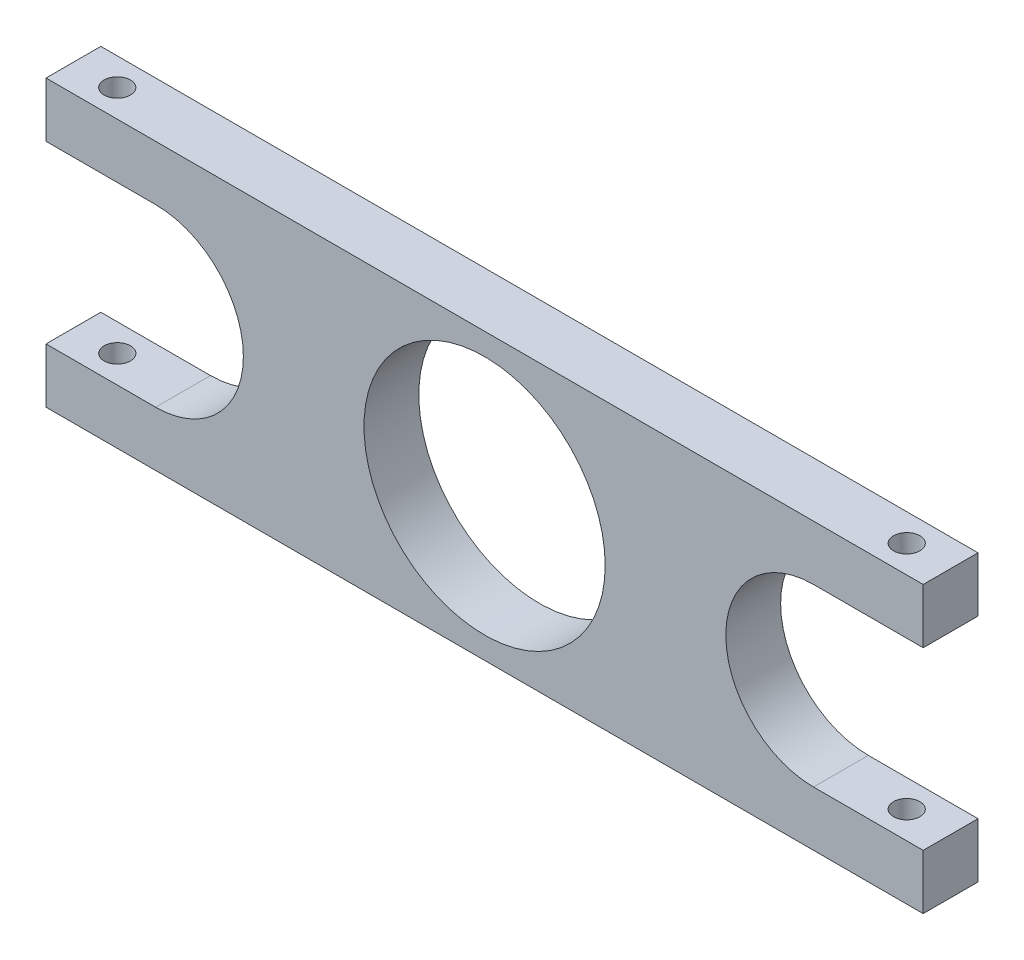
ISO-10303-21;
HEADER;
FILE_DESCRIPTION(('STEP AP214'),'2;1');
FILE_NAME('part.step','',(''),(''),'','','');
FILE_SCHEMA(('AUTOMOTIVE_DESIGN { 1 0 10303 214 1 1 1 1 }'));
ENDSEC;
DATA;
#1=APPLICATION_CONTEXT('core data for automotive mechanical design processes');
#2=APPLICATION_PROTOCOL_DEFINITION('international standard','automotive_design',2000,#1);
#3=PRODUCT_CONTEXT('',#1,'mechanical');
#4=PRODUCT('Part','Part','',(#3));
#5=PRODUCT_RELATED_PRODUCT_CATEGORY('part','',(#4));
#6=PRODUCT_DEFINITION_FORMATION('','',#4);
#7=PRODUCT_DEFINITION_CONTEXT('part definition',#1,'design');
#8=PRODUCT_DEFINITION('design','',#6,#7);
#9=PRODUCT_DEFINITION_SHAPE('','',#8);
#10=(LENGTH_UNIT() NAMED_UNIT(*) SI_UNIT(.MILLI.,.METRE.));
#11=(NAMED_UNIT(*) PLANE_ANGLE_UNIT() SI_UNIT($,.RADIAN.));
#12=(NAMED_UNIT(*) SI_UNIT($,.STERADIAN.) SOLID_ANGLE_UNIT());
#13=UNCERTAINTY_MEASURE_WITH_UNIT(LENGTH_MEASURE(1.E-05),#10,'distance_accuracy_value','');
#14=(GEOMETRIC_REPRESENTATION_CONTEXT(3) GLOBAL_UNCERTAINTY_ASSIGNED_CONTEXT((#13)) GLOBAL_UNIT_ASSIGNED_CONTEXT((#10,
#11,#12)) REPRESENTATION_CONTEXT('',''));
#15=CARTESIAN_POINT('',(0.,0.,0.));
#16=DIRECTION('',(0.,0.,1.));
#17=DIRECTION('',(1.,0.,0.));
#18=AXIS2_PLACEMENT_3D('',#15,#16,#17);
#19=CARTESIAN_POINT('',(80.,26.,5.));
#20=DIRECTION('',(0.,-1.,0.));
#21=DIRECTION('',(1.,0.,0.));
#22=AXIS2_PLACEMENT_3D('',#19,#20,#21);
#23=PLANE('',#22);
#24=CARTESIAN_POINT('',(4.,26.,2.5));
#25=DIRECTION('',(0.,1.,0.));
#26=DIRECTION('',(0.,0.,1.));
#27=AXIS2_PLACEMENT_3D('',#24,#25,#26);
#28=CIRCLE('',#27,1.19999999999999);
#29=CARTESIAN_POINT('',(4.,26.,3.69999999999999));
#30=VERTEX_POINT('',#29);
#31=EDGE_CURVE('E300',#30,#30,#28,.T.);
#32=ORIENTED_EDGE('',*,*,#31,.F.);
#33=EDGE_LOOP('',(#32));
#34=FACE_BOUND('',#33,.T.);
#35=DIRECTION('',(-1.,0.,0.));
#36=VECTOR('',#35,1.);
#37=CARTESIAN_POINT('',(80.,26.,0.));
#38=LINE('',#37,#36);
#39=CARTESIAN_POINT('',(80.,26.,0.));
#40=VERTEX_POINT('',#39);
#41=CARTESIAN_POINT('',(0.,26.,0.));
#42=VERTEX_POINT('',#41);
#43=EDGE_CURVE('E170',#40,#42,#38,.T.);
#44=ORIENTED_EDGE('',*,*,#43,.T.);
#45=DIRECTION('',(0.,0.,-1.));
#46=VECTOR('',#45,1.);
#47=CARTESIAN_POINT('',(0.,26.,5.));
#48=LINE('',#47,#46);
#49=CARTESIAN_POINT('',(0.,26.,5.));
#50=VERTEX_POINT('',#49);
#51=EDGE_CURVE('E181',#50,#42,#48,.T.);
#52=ORIENTED_EDGE('',*,*,#51,.F.);
#53=DIRECTION('',(-1.,0.,0.));
#54=VECTOR('',#53,1.);
#55=CARTESIAN_POINT('',(80.,26.,5.));
#56=LINE('',#55,#54);
#57=CARTESIAN_POINT('',(80.,26.,5.));
#58=VERTEX_POINT('',#57);
#59=EDGE_CURVE('E231',#58,#50,#56,.T.);
#60=ORIENTED_EDGE('',*,*,#59,.F.);
#61=DIRECTION('',(0.,0.,-1.));
#62=VECTOR('',#61,1.);
#63=CARTESIAN_POINT('',(80.,26.,5.));
#64=LINE('',#63,#62);
#65=EDGE_CURVE('E184',#58,#40,#64,.T.);
#66=ORIENTED_EDGE('',*,*,#65,.T.);
#67=EDGE_LOOP('',(#44,#52,#60,#66));
#68=FACE_BOUND('',#67,.T.);
#69=CARTESIAN_POINT('',(76.,26.,2.5));
#70=DIRECTION('',(0.,1.,0.));
#71=DIRECTION('',(0.,0.,1.));
#72=AXIS2_PLACEMENT_3D('',#69,#70,#71);
#73=CIRCLE('',#72,1.19999999999999);
#74=CARTESIAN_POINT('',(76.,26.,3.69999999999999));
#75=VERTEX_POINT('',#74);
#76=EDGE_CURVE('E339',#75,#75,#73,.T.);
#77=ORIENTED_EDGE('',*,*,#76,.F.);
#78=EDGE_LOOP('',(#77));
#79=FACE_BOUND('',#78,.T.);
#80=ADVANCED_FACE('F32',(#34,#68,#79),#23,.F.);
#81=CARTESIAN_POINT('',(70.,13.,5.));
#82=DIRECTION('',(0.,0.,1.));
#83=DIRECTION('',(1.,0.,0.));
#84=AXIS2_PLACEMENT_3D('',#81,#82,#83);
#85=PLANE('',#84);
#86=DIRECTION('',(0.,-1.,0.));
#87=VECTOR('',#86,1.);
#88=CARTESIAN_POINT('',(0.,5.,5.));
#89=LINE('',#88,#87);
#90=CARTESIAN_POINT('',(0.,5.,5.));
#91=VERTEX_POINT('',#90);
#92=CARTESIAN_POINT('',(0.,0.,5.));
#93=VERTEX_POINT('',#92);
#94=EDGE_CURVE('E177',#91,#93,#89,.T.);
#95=ORIENTED_EDGE('',*,*,#94,.T.);
#96=DIRECTION('',(1.,0.,0.));
#97=VECTOR('',#96,1.);
#98=CARTESIAN_POINT('',(0.,0.,5.));
#99=LINE('',#98,#97);
#100=CARTESIAN_POINT('',(80.,0.,5.));
#101=VERTEX_POINT('',#100);
#102=EDGE_CURVE('E104',#93,#101,#99,.T.);
#103=ORIENTED_EDGE('',*,*,#102,.T.);
#104=DIRECTION('',(0.,1.,0.));
#105=VECTOR('',#104,1.);
#106=CARTESIAN_POINT('',(80.,0.,5.));
#107=LINE('',#106,#105);
#108=CARTESIAN_POINT('',(80.,5.,5.));
#109=VERTEX_POINT('',#108);
#110=EDGE_CURVE('E204',#101,#109,#107,.T.);
#111=ORIENTED_EDGE('',*,*,#110,.T.);
#112=DIRECTION('',(-1.,0.,0.));
#113=VECTOR('',#112,1.);
#114=CARTESIAN_POINT('',(80.,5.,5.));
#115=LINE('',#114,#113);
#116=CARTESIAN_POINT('',(70.,5.,5.));
#117=VERTEX_POINT('',#116);
#118=EDGE_CURVE('E223',#109,#117,#115,.T.);
#119=ORIENTED_EDGE('',*,*,#118,.T.);
#120=CARTESIAN_POINT('',(70.,13.,5.));
#121=DIRECTION('',(0.,0.,-1.));
#122=DIRECTION('',(1.,0.,0.));
#123=AXIS2_PLACEMENT_3D('',#120,#121,#122);
#124=CIRCLE('',#123,8.);
#125=CARTESIAN_POINT('',(70.,21.,5.));
#126=VERTEX_POINT('',#125);
#127=EDGE_CURVE('E220',#117,#126,#124,.T.);
#128=ORIENTED_EDGE('',*,*,#127,.T.);
#129=DIRECTION('',(1.,0.,0.));
#130=VECTOR('',#129,1.);
#131=CARTESIAN_POINT('',(70.,21.,5.));
#132=LINE('',#131,#130);
#133=CARTESIAN_POINT('',(80.,21.,5.));
#134=VERTEX_POINT('',#133);
#135=EDGE_CURVE('E222',#126,#134,#132,.T.);
#136=ORIENTED_EDGE('',*,*,#135,.T.);
#137=DIRECTION('',(0.,1.,0.));
#138=VECTOR('',#137,1.);
#139=CARTESIAN_POINT('',(80.,21.,5.));
#140=LINE('',#139,#138);
#141=EDGE_CURVE('E225',#134,#58,#140,.T.);
#142=ORIENTED_EDGE('',*,*,#141,.T.);
#143=ORIENTED_EDGE('',*,*,#59,.T.);
#144=DIRECTION('',(0.,-1.,0.));
#145=VECTOR('',#144,1.);
#146=CARTESIAN_POINT('',(0.,26.,5.));
#147=LINE('',#146,#145);
#148=CARTESIAN_POINT('',(0.,21.,5.));
#149=VERTEX_POINT('',#148);
#150=EDGE_CURVE('E136',#50,#149,#147,.T.);
#151=ORIENTED_EDGE('',*,*,#150,.T.);
#152=DIRECTION('',(1.,0.,0.));
#153=VECTOR('',#152,1.);
#154=CARTESIAN_POINT('',(0.,21.,5.));
#155=LINE('',#154,#153);
#156=CARTESIAN_POINT('',(10.,21.,5.));
#157=VERTEX_POINT('',#156);
#158=EDGE_CURVE('E129',#149,#157,#155,.T.);
#159=ORIENTED_EDGE('',*,*,#158,.T.);
#160=CARTESIAN_POINT('',(9.99999999999999,13.,5.));
#161=DIRECTION('',(0.,0.,-1.));
#162=DIRECTION('',(-1.,0.,0.));
#163=AXIS2_PLACEMENT_3D('',#160,#161,#162);
#164=CIRCLE('',#163,7.99999999999999);
#165=CARTESIAN_POINT('',(10.,5.,5.));
#166=VERTEX_POINT('',#165);
#167=EDGE_CURVE('E134',#157,#166,#164,.T.);
#168=ORIENTED_EDGE('',*,*,#167,.T.);
#169=DIRECTION('',(-1.,0.,0.));
#170=VECTOR('',#169,1.);
#171=CARTESIAN_POINT('',(10.,5.,5.));
#172=LINE('',#171,#170);
#173=EDGE_CURVE('E49',#166,#91,#172,.T.);
#174=ORIENTED_EDGE('',*,*,#173,.T.);
#175=EDGE_LOOP('',(#95,#103,#111,#119,#128,#136,#142,#143,#151,#159,#168,#174));
#176=FACE_BOUND('',#175,.T.);
#177=CARTESIAN_POINT('',(40.,13.,5.));
#178=DIRECTION('',(0.,0.,1.));
#179=DIRECTION('',(1.,0.,0.));
#180=AXIS2_PLACEMENT_3D('',#177,#178,#179);
#181=CIRCLE('',#180,11.);
#182=CARTESIAN_POINT('',(51.,13.,5.));
#183=VERTEX_POINT('',#182);
#184=EDGE_CURVE('E158',#183,#183,#181,.T.);
#185=ORIENTED_EDGE('',*,*,#184,.F.);
#186=EDGE_LOOP('',(#185));
#187=FACE_BOUND('',#186,.T.);
#188=ADVANCED_FACE('F131',(#176,#187),#85,.T.);
#189=CARTESIAN_POINT('',(70.,13.,0.));
#190=DIRECTION('',(0.,0.,1.));
#191=DIRECTION('',(1.,0.,0.));
#192=AXIS2_PLACEMENT_3D('',#189,#190,#191);
#193=PLANE('',#192);
#194=DIRECTION('',(0.,-1.,0.));
#195=VECTOR('',#194,1.);
#196=CARTESIAN_POINT('',(0.,5.,0.));
#197=LINE('',#196,#195);
#198=CARTESIAN_POINT('',(0.,5.,0.));
#199=VERTEX_POINT('',#198);
#200=CARTESIAN_POINT('',(0.,0.,0.));
#201=VERTEX_POINT('',#200);
#202=EDGE_CURVE('E154',#199,#201,#197,.T.);
#203=ORIENTED_EDGE('',*,*,#202,.F.);
#204=DIRECTION('',(-1.,0.,0.));
#205=VECTOR('',#204,1.);
#206=CARTESIAN_POINT('',(10.,5.,0.));
#207=LINE('',#206,#205);
#208=CARTESIAN_POINT('',(10.,5.,0.));
#209=VERTEX_POINT('',#208);
#210=EDGE_CURVE('E96',#209,#199,#207,.T.);
#211=ORIENTED_EDGE('',*,*,#210,.F.);
#212=CARTESIAN_POINT('',(9.99999999999999,13.,0.));
#213=DIRECTION('',(0.,0.,-1.));
#214=DIRECTION('',(-1.,0.,0.));
#215=AXIS2_PLACEMENT_3D('',#212,#213,#214);
#216=CIRCLE('',#215,7.99999999999999);
#217=CARTESIAN_POINT('',(10.,21.,0.));
#218=VERTEX_POINT('',#217);
#219=EDGE_CURVE('E90',#218,#209,#216,.T.);
#220=ORIENTED_EDGE('',*,*,#219,.F.);
#221=DIRECTION('',(1.,0.,0.));
#222=VECTOR('',#221,1.);
#223=CARTESIAN_POINT('',(0.,21.,0.));
#224=LINE('',#223,#222);
#225=CARTESIAN_POINT('',(0.,21.,0.));
#226=VERTEX_POINT('',#225);
#227=EDGE_CURVE('E144',#226,#218,#224,.T.);
#228=ORIENTED_EDGE('',*,*,#227,.F.);
#229=DIRECTION('',(0.,-1.,0.));
#230=VECTOR('',#229,1.);
#231=CARTESIAN_POINT('',(0.,26.,0.));
#232=LINE('',#231,#230);
#233=EDGE_CURVE('E172',#42,#226,#232,.T.);
#234=ORIENTED_EDGE('',*,*,#233,.F.);
#235=ORIENTED_EDGE('',*,*,#43,.F.);
#236=DIRECTION('',(0.,1.,0.));
#237=VECTOR('',#236,1.);
#238=CARTESIAN_POINT('',(80.,21.,0.));
#239=LINE('',#238,#237);
#240=CARTESIAN_POINT('',(80.,21.,0.));
#241=VERTEX_POINT('',#240);
#242=EDGE_CURVE('E168',#241,#40,#239,.T.);
#243=ORIENTED_EDGE('',*,*,#242,.F.);
#244=DIRECTION('',(1.,0.,0.));
#245=VECTOR('',#244,1.);
#246=CARTESIAN_POINT('',(70.,21.,0.));
#247=LINE('',#246,#245);
#248=CARTESIAN_POINT('',(70.,21.,0.));
#249=VERTEX_POINT('',#248);
#250=EDGE_CURVE('E166',#249,#241,#247,.T.);
#251=ORIENTED_EDGE('',*,*,#250,.F.);
#252=CARTESIAN_POINT('',(70.,13.,0.));
#253=DIRECTION('',(0.,0.,-1.));
#254=DIRECTION('',(1.,0.,0.));
#255=AXIS2_PLACEMENT_3D('',#252,#253,#254);
#256=CIRCLE('',#255,8.);
#257=CARTESIAN_POINT('',(70.,5.,0.));
#258=VERTEX_POINT('',#257);
#259=EDGE_CURVE('E164',#258,#249,#256,.T.);
#260=ORIENTED_EDGE('',*,*,#259,.F.);
#261=DIRECTION('',(-1.,0.,0.));
#262=VECTOR('',#261,1.);
#263=CARTESIAN_POINT('',(80.,5.,0.));
#264=LINE('',#263,#262);
#265=CARTESIAN_POINT('',(80.,5.,0.));
#266=VERTEX_POINT('',#265);
#267=EDGE_CURVE('E162',#266,#258,#264,.T.);
#268=ORIENTED_EDGE('',*,*,#267,.F.);
#269=DIRECTION('',(0.,1.,0.));
#270=VECTOR('',#269,1.);
#271=CARTESIAN_POINT('',(80.,0.,0.));
#272=LINE('',#271,#270);
#273=CARTESIAN_POINT('',(80.,0.,0.));
#274=VERTEX_POINT('',#273);
#275=EDGE_CURVE('E160',#274,#266,#272,.T.);
#276=ORIENTED_EDGE('',*,*,#275,.F.);
#277=DIRECTION('',(1.,0.,0.));
#278=VECTOR('',#277,1.);
#279=CARTESIAN_POINT('',(0.,0.,0.));
#280=LINE('',#279,#278);
#281=EDGE_CURVE('E157',#201,#274,#280,.T.);
#282=ORIENTED_EDGE('',*,*,#281,.F.);
#283=EDGE_LOOP('',(#203,#211,#220,#228,#234,#235,#243,#251,#260,#268,#276,#282));
#284=FACE_BOUND('',#283,.T.);
#285=CARTESIAN_POINT('',(40.,13.,0.));
#286=DIRECTION('',(0.,0.,1.));
#287=DIRECTION('',(1.,0.,0.));
#288=AXIS2_PLACEMENT_3D('',#285,#286,#287);
#289=CIRCLE('',#288,11.);
#290=CARTESIAN_POINT('',(51.,13.,0.));
#291=VERTEX_POINT('',#290);
#292=EDGE_CURVE('E311',#291,#291,#289,.T.);
#293=ORIENTED_EDGE('',*,*,#292,.T.);
#294=EDGE_LOOP('',(#293));
#295=FACE_BOUND('',#294,.T.);
#296=ADVANCED_FACE('F208',(#284,#295),#193,.F.);
#297=CARTESIAN_POINT('',(0.,5.,5.));
#298=DIRECTION('',(1.,0.,0.));
#299=DIRECTION('',(0.,1.,0.));
#300=AXIS2_PLACEMENT_3D('',#297,#298,#299);
#301=PLANE('',#300);
#302=ORIENTED_EDGE('',*,*,#202,.T.);
#303=DIRECTION('',(0.,0.,-1.));
#304=VECTOR('',#303,1.);
#305=CARTESIAN_POINT('',(0.,0.,5.));
#306=LINE('',#305,#304);
#307=EDGE_CURVE('E11',#93,#201,#306,.T.);
#308=ORIENTED_EDGE('',*,*,#307,.F.);
#309=ORIENTED_EDGE('',*,*,#94,.F.);
#310=DIRECTION('',(0.,0.,-1.));
#311=VECTOR('',#310,1.);
#312=CARTESIAN_POINT('',(0.,5.,5.));
#313=LINE('',#312,#311);
#314=EDGE_CURVE('E150',#91,#199,#313,.T.);
#315=ORIENTED_EDGE('',*,*,#314,.T.);
#316=EDGE_LOOP('',(#302,#308,#309,#315));
#317=FACE_BOUND('',#316,.T.);
#318=ADVANCED_FACE('F34',(#317),#301,.F.);
#319=CARTESIAN_POINT('',(0.,0.,5.));
#320=DIRECTION('',(0.,1.,0.));
#321=DIRECTION('',(0.,0.,1.));
#322=AXIS2_PLACEMENT_3D('',#319,#320,#321);
#323=PLANE('',#322);
#324=CARTESIAN_POINT('',(76.,0.,2.5));
#325=DIRECTION('',(0.,1.,0.));
#326=DIRECTION('',(0.,0.,1.));
#327=AXIS2_PLACEMENT_3D('',#324,#325,#326);
#328=CIRCLE('',#327,1.19999999999999);
#329=CARTESIAN_POINT('',(76.,0.,3.69999999999999));
#330=VERTEX_POINT('',#329);
#331=EDGE_CURVE('E294',#330,#330,#328,.T.);
#332=ORIENTED_EDGE('',*,*,#331,.T.);
#333=EDGE_LOOP('',(#332));
#334=FACE_BOUND('',#333,.T.);
#335=CARTESIAN_POINT('',(4.,0.,2.5));
#336=DIRECTION('',(0.,1.,0.));
#337=DIRECTION('',(0.,0.,1.));
#338=AXIS2_PLACEMENT_3D('',#335,#336,#337);
#339=CIRCLE('',#338,1.2);
#340=CARTESIAN_POINT('',(4.,0.,3.7));
#341=VERTEX_POINT('',#340);
#342=EDGE_CURVE('E297',#341,#341,#339,.T.);
#343=ORIENTED_EDGE('',*,*,#342,.T.);
#344=EDGE_LOOP('',(#343));
#345=FACE_BOUND('',#344,.T.);
#346=ORIENTED_EDGE('',*,*,#281,.T.);
#347=DIRECTION('',(0.,0.,-1.));
#348=VECTOR('',#347,1.);
#349=CARTESIAN_POINT('',(80.,0.,5.));
#350=LINE('',#349,#348);
#351=EDGE_CURVE('E41',#101,#274,#350,.T.);
#352=ORIENTED_EDGE('',*,*,#351,.F.);
#353=ORIENTED_EDGE('',*,*,#102,.F.);
#354=ORIENTED_EDGE('',*,*,#307,.T.);
#355=EDGE_LOOP('',(#346,#352,#353,#354));
#356=FACE_BOUND('',#355,.T.);
#357=ADVANCED_FACE('F285',(#334,#345,#356),#323,.F.);
#358=CARTESIAN_POINT('',(80.,0.,5.));
#359=DIRECTION('',(-1.,0.,0.));
#360=DIRECTION('',(0.,0.,1.));
#361=AXIS2_PLACEMENT_3D('',#358,#359,#360);
#362=PLANE('',#361);
#363=ORIENTED_EDGE('',*,*,#275,.T.);
#364=DIRECTION('',(0.,0.,-1.));
#365=VECTOR('',#364,1.);
#366=CARTESIAN_POINT('',(80.,5.,5.));
#367=LINE('',#366,#365);
#368=EDGE_CURVE('E196',#109,#266,#367,.T.);
#369=ORIENTED_EDGE('',*,*,#368,.F.);
#370=ORIENTED_EDGE('',*,*,#110,.F.);
#371=ORIENTED_EDGE('',*,*,#351,.T.);
#372=EDGE_LOOP('',(#363,#369,#370,#371));
#373=FACE_BOUND('',#372,.T.);
#374=ADVANCED_FACE('F202',(#373),#362,.F.);
#375=CARTESIAN_POINT('',(80.,5.,5.));
#376=DIRECTION('',(0.,-1.,0.));
#377=DIRECTION('',(0.,0.,-1.));
#378=AXIS2_PLACEMENT_3D('',#375,#376,#377);
#379=PLANE('',#378);
#380=CARTESIAN_POINT('',(76.,5.,2.5));
#381=DIRECTION('',(0.,-1.,0.));
#382=DIRECTION('',(0.,0.,-1.));
#383=AXIS2_PLACEMENT_3D('',#380,#381,#382);
#384=CIRCLE('',#383,1.19999999999999);
#385=CARTESIAN_POINT('',(76.,5.,1.30000000000001));
#386=VERTEX_POINT('',#385);
#387=EDGE_CURVE('E342',#386,#386,#384,.T.);
#388=ORIENTED_EDGE('',*,*,#387,.T.);
#389=EDGE_LOOP('',(#388));
#390=FACE_BOUND('',#389,.T.);
#391=ORIENTED_EDGE('',*,*,#267,.T.);
#392=DIRECTION('',(0.,0.,-1.));
#393=VECTOR('',#392,1.);
#394=CARTESIAN_POINT('',(70.,5.,5.));
#395=LINE('',#394,#393);
#396=EDGE_CURVE('E193',#117,#258,#395,.T.);
#397=ORIENTED_EDGE('',*,*,#396,.F.);
#398=ORIENTED_EDGE('',*,*,#118,.F.);
#399=ORIENTED_EDGE('',*,*,#368,.T.);
#400=EDGE_LOOP('',(#391,#397,#398,#399));
#401=FACE_BOUND('',#400,.T.);
#402=ADVANCED_FACE('F214',(#390,#401),#379,.F.);
#403=CARTESIAN_POINT('',(70.,13.,5.));
#404=DIRECTION('',(0.,0.,-1.));
#405=DIRECTION('',(-1.,0.,0.));
#406=AXIS2_PLACEMENT_3D('',#403,#404,#405);
#407=CYLINDRICAL_SURFACE('',#406,8.);
#408=ORIENTED_EDGE('',*,*,#259,.T.);
#409=DIRECTION('',(0.,0.,-1.));
#410=VECTOR('',#409,1.);
#411=CARTESIAN_POINT('',(70.,21.,5.));
#412=LINE('',#411,#410);
#413=EDGE_CURVE('E190',#126,#249,#412,.T.);
#414=ORIENTED_EDGE('',*,*,#413,.F.);
#415=ORIENTED_EDGE('',*,*,#127,.F.);
#416=ORIENTED_EDGE('',*,*,#396,.T.);
#417=EDGE_LOOP('',(#408,#414,#415,#416));
#418=FACE_BOUND('',#417,.T.);
#419=ADVANCED_FACE('F218',(#418),#407,.F.);
#420=CARTESIAN_POINT('',(70.,21.,5.));
#421=DIRECTION('',(0.,1.,0.));
#422=DIRECTION('',(-1.,0.,0.));
#423=AXIS2_PLACEMENT_3D('',#420,#421,#422);
#424=PLANE('',#423);
#425=CARTESIAN_POINT('',(76.,21.,2.5));
#426=DIRECTION('',(0.,1.,0.));
#427=DIRECTION('',(-1.,0.,0.));
#428=AXIS2_PLACEMENT_3D('',#425,#426,#427);
#429=CIRCLE('',#428,1.19999999999999);
#430=CARTESIAN_POINT('',(74.8,21.,2.5));
#431=VERTEX_POINT('',#430);
#432=EDGE_CURVE('E306',#431,#431,#429,.T.);
#433=ORIENTED_EDGE('',*,*,#432,.T.);
#434=EDGE_LOOP('',(#433));
#435=FACE_BOUND('',#434,.T.);
#436=ORIENTED_EDGE('',*,*,#250,.T.);
#437=DIRECTION('',(0.,0.,-1.));
#438=VECTOR('',#437,1.);
#439=CARTESIAN_POINT('',(80.,21.,5.));
#440=LINE('',#439,#438);
#441=EDGE_CURVE('E187',#134,#241,#440,.T.);
#442=ORIENTED_EDGE('',*,*,#441,.F.);
#443=ORIENTED_EDGE('',*,*,#135,.F.);
#444=ORIENTED_EDGE('',*,*,#413,.T.);
#445=EDGE_LOOP('',(#436,#442,#443,#444));
#446=FACE_BOUND('',#445,.T.);
#447=ADVANCED_FACE('F274',(#435,#446),#424,.F.);
#448=CARTESIAN_POINT('',(80.,21.,5.));
#449=DIRECTION('',(-1.,0.,0.));
#450=DIRECTION('',(0.,0.,1.));
#451=AXIS2_PLACEMENT_3D('',#448,#449,#450);
#452=PLANE('',#451);
#453=ORIENTED_EDGE('',*,*,#242,.T.);
#454=ORIENTED_EDGE('',*,*,#65,.F.);
#455=ORIENTED_EDGE('',*,*,#141,.F.);
#456=ORIENTED_EDGE('',*,*,#441,.T.);
#457=EDGE_LOOP('',(#453,#454,#455,#456));
#458=FACE_BOUND('',#457,.T.);
#459=ADVANCED_FACE('F271',(#458),#452,.F.);
#460=CARTESIAN_POINT('',(0.,26.,5.));
#461=DIRECTION('',(1.,0.,0.));
#462=DIRECTION('',(0.,1.,0.));
#463=AXIS2_PLACEMENT_3D('',#460,#461,#462);
#464=PLANE('',#463);
#465=ORIENTED_EDGE('',*,*,#233,.T.);
#466=DIRECTION('',(0.,0.,-1.));
#467=VECTOR('',#466,1.);
#468=CARTESIAN_POINT('',(0.,21.,5.));
#469=LINE('',#468,#467);
#470=EDGE_CURVE('E145',#149,#226,#469,.T.);
#471=ORIENTED_EDGE('',*,*,#470,.F.);
#472=ORIENTED_EDGE('',*,*,#150,.F.);
#473=ORIENTED_EDGE('',*,*,#51,.T.);
#474=EDGE_LOOP('',(#465,#471,#472,#473));
#475=FACE_BOUND('',#474,.T.);
#476=ADVANCED_FACE('F241',(#475),#464,.F.);
#477=CARTESIAN_POINT('',(0.,21.,5.));
#478=DIRECTION('',(0.,1.,0.));
#479=DIRECTION('',(0.,0.,1.));
#480=AXIS2_PLACEMENT_3D('',#477,#478,#479);
#481=PLANE('',#480);
#482=CARTESIAN_POINT('',(4.,21.,2.5));
#483=DIRECTION('',(0.,1.,0.));
#484=DIRECTION('',(0.,0.,1.));
#485=AXIS2_PLACEMENT_3D('',#482,#483,#484);
#486=CIRCLE('',#485,1.19999999999999);
#487=CARTESIAN_POINT('',(4.,21.,3.69999999999999));
#488=VERTEX_POINT('',#487);
#489=EDGE_CURVE('E299',#488,#488,#486,.T.);
#490=ORIENTED_EDGE('',*,*,#489,.T.);
#491=EDGE_LOOP('',(#490));
#492=FACE_BOUND('',#491,.T.);
#493=ORIENTED_EDGE('',*,*,#227,.T.);
#494=DIRECTION('',(0.,0.,-1.));
#495=VECTOR('',#494,1.);
#496=CARTESIAN_POINT('',(10.,21.,5.));
#497=LINE('',#496,#495);
#498=EDGE_CURVE('E141',#157,#218,#497,.T.);
#499=ORIENTED_EDGE('',*,*,#498,.F.);
#500=ORIENTED_EDGE('',*,*,#158,.F.);
#501=ORIENTED_EDGE('',*,*,#470,.T.);
#502=EDGE_LOOP('',(#493,#499,#500,#501));
#503=FACE_BOUND('',#502,.T.);
#504=ADVANCED_FACE('F142',(#492,#503),#481,.F.);
#505=CARTESIAN_POINT('',(9.99999999999999,13.,5.));
#506=DIRECTION('',(0.,0.,-1.));
#507=DIRECTION('',(-1.,0.,0.));
#508=AXIS2_PLACEMENT_3D('',#505,#506,#507);
#509=CYLINDRICAL_SURFACE('',#508,7.99999999999999);
#510=ORIENTED_EDGE('',*,*,#219,.T.);
#511=DIRECTION('',(0.,0.,-1.));
#512=VECTOR('',#511,1.);
#513=CARTESIAN_POINT('',(10.,5.,5.));
#514=LINE('',#513,#512);
#515=EDGE_CURVE('E146',#166,#209,#514,.T.);
#516=ORIENTED_EDGE('',*,*,#515,.F.);
#517=ORIENTED_EDGE('',*,*,#167,.F.);
#518=ORIENTED_EDGE('',*,*,#498,.T.);
#519=EDGE_LOOP('',(#510,#516,#517,#518));
#520=FACE_BOUND('',#519,.T.);
#521=ADVANCED_FACE('F148',(#520),#509,.F.);
#522=CARTESIAN_POINT('',(10.,5.,5.));
#523=DIRECTION('',(0.,-1.,0.));
#524=DIRECTION('',(1.,0.,0.));
#525=AXIS2_PLACEMENT_3D('',#522,#523,#524);
#526=PLANE('',#525);
#527=CARTESIAN_POINT('',(4.,5.,2.5));
#528=DIRECTION('',(0.,-1.,0.));
#529=DIRECTION('',(1.,0.,0.));
#530=AXIS2_PLACEMENT_3D('',#527,#528,#529);
#531=CIRCLE('',#530,1.19999999999999);
#532=CARTESIAN_POINT('',(5.19999999999999,5.,2.5));
#533=VERTEX_POINT('',#532);
#534=EDGE_CURVE('E303',#533,#533,#531,.T.);
#535=ORIENTED_EDGE('',*,*,#534,.T.);
#536=EDGE_LOOP('',(#535));
#537=FACE_BOUND('',#536,.T.);
#538=ORIENTED_EDGE('',*,*,#210,.T.);
#539=ORIENTED_EDGE('',*,*,#314,.F.);
#540=ORIENTED_EDGE('',*,*,#173,.F.);
#541=ORIENTED_EDGE('',*,*,#515,.T.);
#542=EDGE_LOOP('',(#538,#539,#540,#541));
#543=FACE_BOUND('',#542,.T.);
#544=ADVANCED_FACE('F245',(#537,#543),#526,.F.);
#545=CARTESIAN_POINT('',(40.,13.,5.));
#546=DIRECTION('',(0.,0.,-1.));
#547=DIRECTION('',(-1.,0.,0.));
#548=AXIS2_PLACEMENT_3D('',#545,#546,#547);
#549=CYLINDRICAL_SURFACE('',#548,11.);
#550=ORIENTED_EDGE('',*,*,#184,.T.);
#551=EDGE_LOOP('',(#550));
#552=FACE_BOUND('',#551,.T.);
#553=ORIENTED_EDGE('',*,*,#292,.F.);
#554=EDGE_LOOP('',(#553));
#555=FACE_BOUND('',#554,.T.);
#556=ADVANCED_FACE('F247',(#552,#555),#549,.F.);
#557=CARTESIAN_POINT('',(4.,26.,2.5));
#558=DIRECTION('',(0.,1.,0.));
#559=DIRECTION('',(0.,0.,1.));
#560=AXIS2_PLACEMENT_3D('',#557,#558,#559);
#561=CYLINDRICAL_SURFACE('',#560,1.19999999999999);
#562=ORIENTED_EDGE('',*,*,#342,.F.);
#563=EDGE_LOOP('',(#562));
#564=FACE_BOUND('',#563,.T.);
#565=ORIENTED_EDGE('',*,*,#534,.F.);
#566=EDGE_LOOP('',(#565));
#567=FACE_BOUND('',#566,.T.);
#568=ADVANCED_FACE('F254',(#564,#567),#561,.F.);
#569=ORIENTED_EDGE('',*,*,#31,.T.);
#570=EDGE_LOOP('',(#569));
#571=FACE_BOUND('',#570,.T.);
#572=ORIENTED_EDGE('',*,*,#489,.F.);
#573=EDGE_LOOP('',(#572));
#574=FACE_BOUND('',#573,.T.);
#575=ADVANCED_FACE('F325',(#571,#574),#561,.F.);
#576=CARTESIAN_POINT('',(76.,26.,2.5));
#577=DIRECTION('',(0.,1.,0.));
#578=DIRECTION('',(0.,0.,1.));
#579=AXIS2_PLACEMENT_3D('',#576,#577,#578);
#580=CYLINDRICAL_SURFACE('',#579,1.19999999999999);
#581=ORIENTED_EDGE('',*,*,#76,.T.);
#582=EDGE_LOOP('',(#581));
#583=FACE_BOUND('',#582,.T.);
#584=ORIENTED_EDGE('',*,*,#432,.F.);
#585=EDGE_LOOP('',(#584));
#586=FACE_BOUND('',#585,.T.);
#587=ADVANCED_FACE('F326',(#583,#586),#580,.F.);
#588=ORIENTED_EDGE('',*,*,#331,.F.);
#589=EDGE_LOOP('',(#588));
#590=FACE_BOUND('',#589,.T.);
#591=ORIENTED_EDGE('',*,*,#387,.F.);
#592=EDGE_LOOP('',(#591));
#593=FACE_BOUND('',#592,.T.);
#594=ADVANCED_FACE('F328',(#590,#593),#580,.F.);
#595=CLOSED_SHELL('',(#80,#188,#296,#318,#357,#374,#402,#419,#447,#459,#476,#504,#521,#544,#556,
#568,#575,#587,#594));
#596=MANIFOLD_SOLID_BREP('B2',#595);
#597=ADVANCED_BREP_SHAPE_REPRESENTATION('',(#18,#596),#14);
#598=SHAPE_DEFINITION_REPRESENTATION(#9,#597);
ENDSEC;
END-ISO-10303-21;
